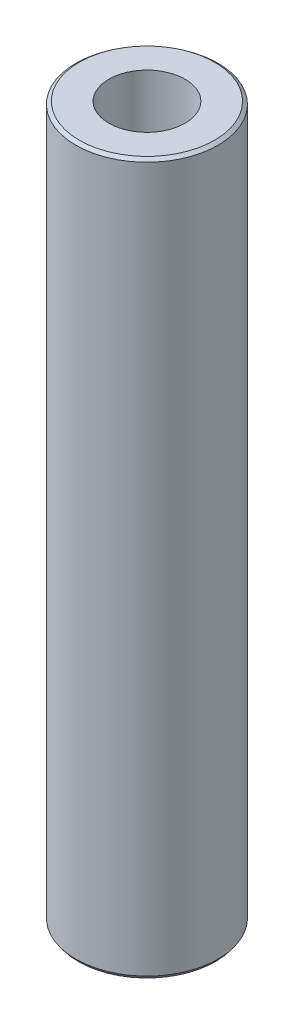
ISO-10303-21;
HEADER;
FILE_DESCRIPTION(('STEP AP214'),'2;1');
FILE_NAME('part.step','',(''),(''),'','','');
FILE_SCHEMA(('AUTOMOTIVE_DESIGN { 1 0 10303 214 1 1 1 1 }'));
ENDSEC;
DATA;
#1=APPLICATION_CONTEXT('core data for automotive mechanical design processes');
#2=APPLICATION_PROTOCOL_DEFINITION('international standard','automotive_design',2000,#1);
#3=PRODUCT_CONTEXT('',#1,'mechanical');
#4=PRODUCT('Part','Part','',(#3));
#5=PRODUCT_RELATED_PRODUCT_CATEGORY('part','',(#4));
#6=PRODUCT_DEFINITION_FORMATION('','',#4);
#7=PRODUCT_DEFINITION_CONTEXT('part definition',#1,'design');
#8=PRODUCT_DEFINITION('design','',#6,#7);
#9=PRODUCT_DEFINITION_SHAPE('','',#8);
#10=(LENGTH_UNIT() NAMED_UNIT(*) SI_UNIT(.MILLI.,.METRE.));
#11=(NAMED_UNIT(*) PLANE_ANGLE_UNIT() SI_UNIT($,.RADIAN.));
#12=(NAMED_UNIT(*) SI_UNIT($,.STERADIAN.) SOLID_ANGLE_UNIT());
#13=UNCERTAINTY_MEASURE_WITH_UNIT(LENGTH_MEASURE(1.E-05),#10,'distance_accuracy_value','');
#14=(GEOMETRIC_REPRESENTATION_CONTEXT(3) GLOBAL_UNCERTAINTY_ASSIGNED_CONTEXT((#13)) GLOBAL_UNIT_ASSIGNED_CONTEXT((#10,
#11,#12)) REPRESENTATION_CONTEXT('',''));
#15=CARTESIAN_POINT('',(0.,0.,0.));
#16=DIRECTION('',(0.,0.,1.));
#17=DIRECTION('',(1.,0.,0.));
#18=AXIS2_PLACEMENT_3D('',#15,#16,#17);
#19=CARTESIAN_POINT('',(0.,600.,0.));
#20=DIRECTION('',(0.,-1.,0.));
#21=DIRECTION('',(0.,0.,-1.));
#22=AXIS2_PLACEMENT_3D('',#19,#20,#21);
#23=CYLINDRICAL_SURFACE('',#22,60.);
#24=CARTESIAN_POINT('',(0.,597.798648369189,0.));
#25=DIRECTION('',(0.,1.,0.));
#26=DIRECTION('',(0.,0.,1.));
#27=AXIS2_PLACEMENT_3D('',#24,#25,#26);
#28=CIRCLE('',#27,60.);
#29=CARTESIAN_POINT('',(0.,597.798648369189,60.));
#30=VERTEX_POINT('',#29);
#31=EDGE_CURVE('E50',#30,#30,#28,.F.);
#32=ORIENTED_EDGE('',*,*,#31,.T.);
#33=EDGE_LOOP('',(#32));
#34=FACE_BOUND('',#33,.T.);
#35=CARTESIAN_POINT('',(0.,2.92752835036436,0.));
#36=DIRECTION('',(0.,1.,0.));
#37=DIRECTION('',(0.,0.,1.));
#38=AXIS2_PLACEMENT_3D('',#35,#36,#37);
#39=CIRCLE('',#38,60.);
#40=CARTESIAN_POINT('',(0.,2.92752835036436,60.));
#41=VERTEX_POINT('',#40);
#42=EDGE_CURVE('E51',#41,#41,#39,.T.);
#43=ORIENTED_EDGE('',*,*,#42,.T.);
#44=EDGE_LOOP('',(#43));
#45=FACE_BOUND('',#44,.T.);
#46=ADVANCED_FACE('F39',(#34,#45),#23,.T.);
#47=CARTESIAN_POINT('',(0.,600.,0.));
#48=DIRECTION('',(0.,1.,0.));
#49=DIRECTION('',(0.,0.,1.));
#50=AXIS2_PLACEMENT_3D('',#47,#48,#49);
#51=PLANE('',#50);
#52=CARTESIAN_POINT('',(0.,600.,0.));
#53=DIRECTION('',(0.,1.,0.));
#54=DIRECTION('',(0.,0.,1.));
#55=AXIS2_PLACEMENT_3D('',#52,#53,#54);
#56=CIRCLE('',#55,57.0724716496357);
#57=CARTESIAN_POINT('',(0.,600.,57.0724716496357));
#58=VERTEX_POINT('',#57);
#59=EDGE_CURVE('E54',#58,#58,#56,.T.);
#60=ORIENTED_EDGE('',*,*,#59,.T.);
#61=EDGE_LOOP('',(#60));
#62=FACE_BOUND('',#61,.T.);
#63=CARTESIAN_POINT('',(0.,600.,0.));
#64=DIRECTION('',(0.,1.,0.));
#65=DIRECTION('',(0.,0.,1.));
#66=AXIS2_PLACEMENT_3D('',#63,#64,#65);
#67=CIRCLE('',#66,32.1892660561963);
#68=CARTESIAN_POINT('',(0.,600.,32.1892660561963));
#69=VERTEX_POINT('',#68);
#70=EDGE_CURVE('E58',#69,#69,#67,.T.);
#71=ORIENTED_EDGE('',*,*,#70,.F.);
#72=EDGE_LOOP('',(#71));
#73=FACE_BOUND('',#72,.T.);
#74=ADVANCED_FACE('F69',(#62,#73),#51,.T.);
#75=CARTESIAN_POINT('',(0.,0.,0.));
#76=DIRECTION('',(0.,1.,0.));
#77=DIRECTION('',(0.,0.,1.));
#78=AXIS2_PLACEMENT_3D('',#75,#76,#77);
#79=PLANE('',#78);
#80=CARTESIAN_POINT('',(0.,0.,0.));
#81=DIRECTION('',(0.,1.,0.));
#82=DIRECTION('',(0.,0.,1.));
#83=AXIS2_PLACEMENT_3D('',#80,#81,#82);
#84=CIRCLE('',#83,57.7986483691893);
#85=CARTESIAN_POINT('',(0.,0.,57.7986483691893));
#86=VERTEX_POINT('',#85);
#87=EDGE_CURVE('E10',#86,#86,#84,.F.);
#88=ORIENTED_EDGE('',*,*,#87,.T.);
#89=EDGE_LOOP('',(#88));
#90=FACE_BOUND('',#89,.T.);
#91=CARTESIAN_POINT('',(0.,0.,0.));
#92=DIRECTION('',(0.,1.,0.));
#93=DIRECTION('',(0.,0.,1.));
#94=AXIS2_PLACEMENT_3D('',#91,#92,#93);
#95=CIRCLE('',#94,32.1892660561963);
#96=CARTESIAN_POINT('',(0.,0.,32.1892660561963));
#97=VERTEX_POINT('',#96);
#98=EDGE_CURVE('E63',#97,#97,#95,.T.);
#99=ORIENTED_EDGE('',*,*,#98,.T.);
#100=EDGE_LOOP('',(#99));
#101=FACE_BOUND('',#100,.T.);
#102=ADVANCED_FACE('F75',(#90,#101),#79,.F.);
#103=CARTESIAN_POINT('',(0.,600.,0.));
#104=DIRECTION('',(0.,-1.,0.));
#105=DIRECTION('',(0.,0.,-1.));
#106=AXIS2_PLACEMENT_3D('',#103,#104,#105);
#107=CYLINDRICAL_SURFACE('',#106,32.1892660561963);
#108=ORIENTED_EDGE('',*,*,#70,.T.);
#109=EDGE_LOOP('',(#108));
#110=FACE_BOUND('',#109,.T.);
#111=ORIENTED_EDGE('',*,*,#98,.F.);
#112=EDGE_LOOP('',(#111));
#113=FACE_BOUND('',#112,.T.);
#114=ADVANCED_FACE('F70',(#110,#113),#107,.F.);
#115=CARTESIAN_POINT('',(0.,600.,0.));
#116=DIRECTION('',(0.,-1.,0.));
#117=DIRECTION('',(0.,0.,-1.));
#118=AXIS2_PLACEMENT_3D('',#115,#116,#117);
#119=CONICAL_SURFACE('',#118,57.0724716496357,0.926049108433798);
#120=ORIENTED_EDGE('',*,*,#31,.F.);
#121=EDGE_LOOP('',(#120));
#122=FACE_BOUND('',#121,.T.);
#123=ORIENTED_EDGE('',*,*,#59,.F.);
#124=EDGE_LOOP('',(#123));
#125=FACE_BOUND('',#124,.T.);
#126=ADVANCED_FACE('F81',(#122,#125),#119,.T.);
#127=CARTESIAN_POINT('',(0.,2.92752835036436,0.));
#128=DIRECTION('',(0.,1.,0.));
#129=DIRECTION('',(0.,0.,1.));
#130=AXIS2_PLACEMENT_3D('',#127,#128,#129);
#131=CONICAL_SURFACE('',#130,60.,0.644747218361089);
#132=CARTESIAN_POINT('',(0.,0.,57.7986483691893));
#133=CARTESIAN_POINT('',(0.,0.0304950869829635,57.8215791153436));
#134=CARTESIAN_POINT('',(0.,0.060990173965925,57.8445098614978));
#135=CARTESIAN_POINT('',(0.,0.121980347931848,57.8903713538064));
#136=CARTESIAN_POINT('',(0.,0.152475434914809,57.9133020999607));
#137=CARTESIAN_POINT('',(0.,0.213465608880734,57.9591635922692));
#138=CARTESIAN_POINT('',(0.,0.243960695863697,57.9820943384235));
#139=CARTESIAN_POINT('',(0.,0.304950869829621,58.0279558307321));
#140=CARTESIAN_POINT('',(0.,0.335445956812582,58.0508865768864));
#141=CARTESIAN_POINT('',(0.,0.396436130778506,58.0967480691949));
#142=CARTESIAN_POINT('',(0.,0.426931217761469,58.1196788153492));
#143=CARTESIAN_POINT('',(0.,0.487921391727394,58.1655403076577));
#144=CARTESIAN_POINT('',(0.,0.518416478710355,58.188471053812));
#145=CARTESIAN_POINT('',(0.,0.579406652676279,58.2343325461206));
#146=CARTESIAN_POINT('',(0.,0.609901739659242,58.2572632922749));
#147=CARTESIAN_POINT('',(0.,0.670891913625166,58.3031247845834));
#148=CARTESIAN_POINT('',(0.,0.701387000608127,58.3260555307377));
#149=CARTESIAN_POINT('',(0.,0.762377174574051,58.3719170230463));
#150=CARTESIAN_POINT('',(0.,0.792872261557015,58.3948477692005));
#151=CARTESIAN_POINT('',(0.,0.853862435522939,58.4407092615091));
#152=CARTESIAN_POINT('',(0.,0.8843575225059,58.4636400076634));
#153=CARTESIAN_POINT('',(0.,0.945347696471824,58.5095014999719));
#154=CARTESIAN_POINT('',(0.,0.975842783454787,58.5324322461262));
#155=CARTESIAN_POINT('',(0.,1.03683295742071,58.5782937384348));
#156=CARTESIAN_POINT('',(0.,1.06732804440367,58.601224484589));
#157=CARTESIAN_POINT('',(0.,1.1283182183696,58.6470859768976));
#158=CARTESIAN_POINT('',(0.,1.15881330535256,58.6700167230519));
#159=CARTESIAN_POINT('',(0.,1.21980347931848,58.7158782153604));
#160=CARTESIAN_POINT('',(0.,1.25029856630145,58.7388089615147));
#161=CARTESIAN_POINT('',(0.,1.31128874026737,58.7846704538233));
#162=CARTESIAN_POINT('',(0.,1.34178382725033,58.8076011999775));
#163=CARTESIAN_POINT('',(0.,1.40277400121626,58.8534626922861));
#164=CARTESIAN_POINT('',(0.,1.43326908819922,58.8763934384404));
#165=CARTESIAN_POINT('',(0.,1.49425926216514,58.9222549307489));
#166=CARTESIAN_POINT('',(0.,1.52475434914811,58.9451856769032));
#167=CARTESIAN_POINT('',(0.,1.58574452311403,58.9910471692118));
#168=CARTESIAN_POINT('',(0.,1.61623961009699,59.013977915366));
#169=CARTESIAN_POINT('',(0.,1.67722978406291,59.0598394076746));
#170=CARTESIAN_POINT('',(0.,1.70772487104588,59.0827701538289));
#171=CARTESIAN_POINT('',(0.,1.7687150450118,59.1286316461374));
#172=CARTESIAN_POINT('',(0.,1.79921013199476,59.1515623922917));
#173=CARTESIAN_POINT('',(0.,1.86020030596069,59.1974238846003));
#174=CARTESIAN_POINT('',(0.,1.89069539294365,59.2203546307545));
#175=CARTESIAN_POINT('',(0.,1.95168556690957,59.2662161230631));
#176=CARTESIAN_POINT('',(0.,1.98218065389254,59.2891468692174));
#177=CARTESIAN_POINT('',(0.,2.04317082785846,59.3350083615259));
#178=CARTESIAN_POINT('',(0.,2.07366591484142,59.3579391076802));
#179=CARTESIAN_POINT('',(0.,2.13465608880735,59.4038005999888));
#180=CARTESIAN_POINT('',(0.,2.16515117579031,59.426731346143));
#181=CARTESIAN_POINT('',(0.,2.22614134975623,59.4725928384516));
#182=CARTESIAN_POINT('',(0.,2.25663643673919,59.4955235846059));
#183=CARTESIAN_POINT('',(0.,2.31762661070512,59.5413850769144));
#184=CARTESIAN_POINT('',(0.,2.34812169768808,59.5643158230687));
#185=CARTESIAN_POINT('',(0.,2.40911187165401,59.6101773153773));
#186=CARTESIAN_POINT('',(0.,2.43960695863697,59.6331080615315));
#187=CARTESIAN_POINT('',(0.,2.50059713260289,59.6789695538401));
#188=CARTESIAN_POINT('',(0.,2.53109221958585,59.7019002999944));
#189=CARTESIAN_POINT('',(0.,2.59208239355178,59.7477617923029));
#190=CARTESIAN_POINT('',(0.,2.62257748053474,59.7706925384572));
#191=CARTESIAN_POINT('',(0.,2.68356765450066,59.8165540307658));
#192=CARTESIAN_POINT('',(0.,2.71406274148363,59.83948477692));
#193=CARTESIAN_POINT('',(0.,2.77505291544955,59.8853462692286));
#194=CARTESIAN_POINT('',(0.,2.80554800243251,59.9082770153829));
#195=CARTESIAN_POINT('',(0.,2.86653817639844,59.9541385076914));
#196=CARTESIAN_POINT('',(0.,2.8970332633814,59.9770692538457));
#197=CARTESIAN_POINT('',(0.,2.92752835036436,60.));
#198=B_SPLINE_CURVE_WITH_KNOTS('',3,(#132,#133,#134,#135,#136,#137,#138,#139,#140,#141,#142,
#143,#144,#145,#146,#147,#148,#149,#150,#151,#152,#153,#154,#155,#156,#157,#158,#159,#160,#161,
#162,#163,#164,#165,#166,#167,#168,#169,#170,#171,#172,#173,#174,#175,#176,#177,#178,#179,#180,
#181,#182,#183,#184,#185,#186,#187,#188,#189,#190,#191,#192,#193,#194,#195,#196,#197),
.UNSPECIFIED.,.F.,.F.,(4,2,2,2,2,2,2,2,2,2,2,2,2,2,2,2,2,2,2,2,2,2,2,2,2,2,2,2,2,2,2,2,4),(0.,
0.11446364070574,0.228927281411485,0.343390922117225,0.45785456282297,0.57231820352871,
0.686781844234454,0.801245484940195,0.915709125645939,1.03017276635168,1.14463640705742,
1.25910004776316,1.37356368846891,1.48802732917465,1.60249096988039,1.71695461058613,
1.83141825129188,1.94588189199762,2.06034553270336,2.1748091734091,2.28927281411485,
2.40373645482059,2.51820009552633,2.63266373623207,2.74712737693782,2.86159101764356,
2.9760546583493,3.09051829905505,3.20498193976079,3.31944558046653,3.43390922117227,
3.54837286187802,3.66283650258376),.UNSPECIFIED.);
#199=EDGE_CURVE('BSEAM45',#86,#41,#198,.T.);
#200=ORIENTED_EDGE('',*,*,#87,.F.);
#201=ORIENTED_EDGE('',*,*,#42,.F.);
#202=ORIENTED_EDGE('',*,*,#199,.T.);
#203=ORIENTED_EDGE('',*,*,#199,.F.);
#204=EDGE_LOOP('',(#200,#202,#201,#203));
#205=FACE_BOUND('',#204,.T.);
#206=ADVANCED_FACE('F45',(#205),#131,.T.);
#207=CLOSED_SHELL('',(#46,#74,#102,#114,#126,#206));
#208=MANIFOLD_SOLID_BREP('B2',#207);
#209=ADVANCED_BREP_SHAPE_REPRESENTATION('',(#18,#208),#14);
#210=SHAPE_DEFINITION_REPRESENTATION(#9,#209);
ENDSEC;
END-ISO-10303-21;
